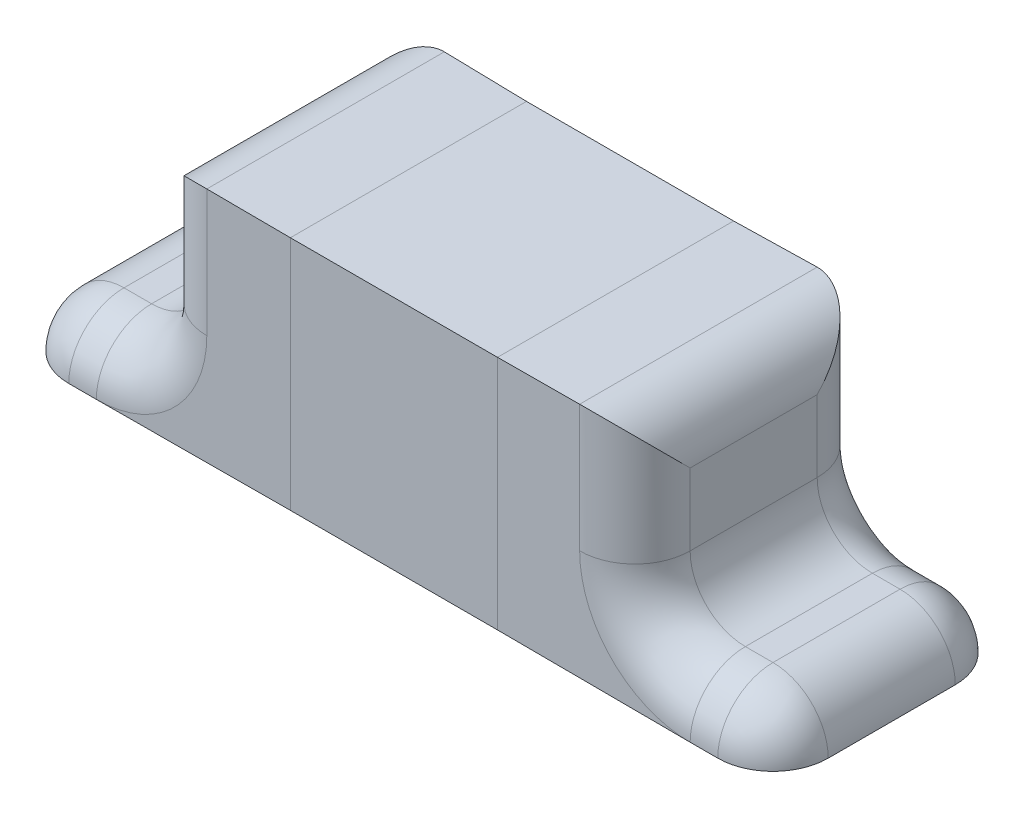
ISO-10303-21;
HEADER;
FILE_DESCRIPTION(('STEP AP214'),'2;1');
FILE_NAME('part.step','',(''),(''),'','','');
FILE_SCHEMA(('AUTOMOTIVE_DESIGN { 1 0 10303 214 1 1 1 1 }'));
ENDSEC;
DATA;
#1=APPLICATION_CONTEXT('core data for automotive mechanical design processes');
#2=APPLICATION_PROTOCOL_DEFINITION('international standard','automotive_design',2000,#1);
#3=PRODUCT_CONTEXT('',#1,'mechanical');
#4=PRODUCT('Part','Part','',(#3));
#5=PRODUCT_RELATED_PRODUCT_CATEGORY('part','',(#4));
#6=PRODUCT_DEFINITION_FORMATION('','',#4);
#7=PRODUCT_DEFINITION_CONTEXT('part definition',#1,'design');
#8=PRODUCT_DEFINITION('design','',#6,#7);
#9=PRODUCT_DEFINITION_SHAPE('','',#8);
#10=(LENGTH_UNIT() NAMED_UNIT(*) SI_UNIT(.MILLI.,.METRE.));
#11=(NAMED_UNIT(*) PLANE_ANGLE_UNIT() SI_UNIT($,.RADIAN.));
#12=(NAMED_UNIT(*) SI_UNIT($,.STERADIAN.) SOLID_ANGLE_UNIT());
#13=UNCERTAINTY_MEASURE_WITH_UNIT(LENGTH_MEASURE(1.E-05),#10,'distance_accuracy_value','');
#14=(GEOMETRIC_REPRESENTATION_CONTEXT(3) GLOBAL_UNCERTAINTY_ASSIGNED_CONTEXT((#13)) GLOBAL_UNIT_ASSIGNED_CONTEXT((#10,
#11,#12)) REPRESENTATION_CONTEXT('',''));
#15=CARTESIAN_POINT('',(0.,0.,0.));
#16=DIRECTION('',(0.,0.,1.));
#17=DIRECTION('',(1.,0.,0.));
#18=AXIS2_PLACEMENT_3D('',#15,#16,#17);
#19=CARTESIAN_POINT('',(0.875,0.,0.));
#20=DIRECTION('',(-1.,0.,0.));
#21=DIRECTION('',(0.,0.,1.));
#22=AXIS2_PLACEMENT_3D('',#19,#20,#21);
#23=PLANE('',#22);
#24=DIRECTION('',(0.,1.,0.));
#25=VECTOR('',#24,1.);
#26=CARTESIAN_POINT('',(0.875,0.,-0.23));
#27=LINE('',#26,#25);
#28=CARTESIAN_POINT('',(0.875,0.398442990090282,-0.23));
#29=VERTEX_POINT('',#28);
#30=CARTESIAN_POINT('',(0.875,0.658442990090282,-0.23));
#31=VERTEX_POINT('',#30);
#32=EDGE_CURVE('E895',#29,#31,#27,.T.);
#33=ORIENTED_EDGE('',*,*,#32,.T.);
#34=DIRECTION('',(0.,0.,1.));
#35=VECTOR('',#34,1.);
#36=CARTESIAN_POINT('',(0.875,0.658442990090282,0.));
#37=LINE('',#36,#35);
#38=CARTESIAN_POINT('',(0.875,0.658442990090282,0.23));
#39=VERTEX_POINT('',#38);
#40=EDGE_CURVE('E453',#31,#39,#37,.T.);
#41=ORIENTED_EDGE('',*,*,#40,.T.);
#42=DIRECTION('',(0.,-1.,0.));
#43=VECTOR('',#42,1.);
#44=CARTESIAN_POINT('',(0.875,0.,0.23));
#45=LINE('',#44,#43);
#46=CARTESIAN_POINT('',(0.875,0.398442990090282,0.23));
#47=VERTEX_POINT('',#46);
#48=EDGE_CURVE('E917',#39,#47,#45,.T.);
#49=ORIENTED_EDGE('',*,*,#48,.T.);
#50=DIRECTION('',(0.,0.,1.));
#51=VECTOR('',#50,1.);
#52=CARTESIAN_POINT('',(0.875,0.398442990090282,-0.43));
#53=LINE('',#52,#51);
#54=EDGE_CURVE('E248',#47,#29,#53,.F.);
#55=ORIENTED_EDGE('',*,*,#54,.T.);
#56=EDGE_LOOP('',(#33,#41,#49,#55));
#57=FACE_BOUND('',#56,.T.);
#58=ADVANCED_FACE('F37',(#57),#23,.F.);
#59=CARTESIAN_POINT('',(0.375,0.,-0.425));
#60=DIRECTION('',(0.,0.,1.));
#61=DIRECTION('',(1.,0.,0.));
#62=AXIS2_PLACEMENT_3D('',#59,#60,#61);
#63=PLANE('',#62);
#64=CARTESIAN_POINT('',(-0.375,0.,-0.425));
#65=DIRECTION('',(0.,1.,0.));
#66=VECTOR('',#65,1.);
#67=LINE('',#64,#66);
#68=CARTESIAN_POINT('',(-0.375,-0.000778504954858498,-0.4275));
#69=VERTEX_POINT('',#68);
#70=CARTESIAN_POINT('',(-0.375,0.854221495045141,-0.4275));
#71=VERTEX_POINT('',#70);
#72=EDGE_CURVE('E200',#69,#71,#67,.T.);
#73=ORIENTED_EDGE('',*,*,#72,.T.);
#74=DIRECTION('',(-1.,0.,0.));
#75=VECTOR('',#74,1.);
#76=CARTESIAN_POINT('',(0.375,0.850000000000001,-0.425));
#77=LINE('',#76,#75);
#78=CARTESIAN_POINT('',(0.375,0.854221495045141,-0.4275));
#79=VERTEX_POINT('',#78);
#80=EDGE_CURVE('E245',#79,#71,#77,.T.);
#81=ORIENTED_EDGE('',*,*,#80,.F.);
#82=CARTESIAN_POINT('',(0.375,-0.00155700990971792,-0.43));
#83=DIRECTION('',(0.,1.,0.));
#84=VECTOR('',#83,1.);
#85=LINE('',#82,#84);
#86=CARTESIAN_POINT('',(0.375,-0.000778504954858498,-0.4275));
#87=VERTEX_POINT('',#86);
#88=EDGE_CURVE('E225',#87,#79,#85,.T.);
#89=ORIENTED_EDGE('',*,*,#88,.F.);
#90=DIRECTION('',(-1.,0.,0.));
#91=VECTOR('',#90,1.);
#92=CARTESIAN_POINT('',(0.375,0.,-0.425));
#93=LINE('',#92,#91);
#94=EDGE_CURVE('E221',#87,#69,#93,.T.);
#95=ORIENTED_EDGE('',*,*,#94,.T.);
#96=EDGE_LOOP('',(#73,#81,#89,#95));
#97=FACE_BOUND('',#96,.T.);
#98=ADVANCED_FACE('F230',(#97),#63,.F.);
#99=CARTESIAN_POINT('',(0.375,0.850000000000001,0.425));
#100=DIRECTION('',(0.,-1.,0.));
#101=DIRECTION('',(0.,0.,-1.));
#102=AXIS2_PLACEMENT_3D('',#99,#100,#101);
#103=PLANE('',#102);
#104=CARTESIAN_POINT('',(-0.375,0.850000000000001,-0.425));
#105=DIRECTION('',(0.,0.,1.));
#106=VECTOR('',#105,1.);
#107=LINE('',#104,#106);
#108=CARTESIAN_POINT('',(-0.375,0.854221495045141,0.4275));
#109=VERTEX_POINT('',#108);
#110=EDGE_CURVE('E211',#71,#109,#107,.T.);
#111=ORIENTED_EDGE('',*,*,#110,.T.);
#112=DIRECTION('',(-1.,0.,0.));
#113=VECTOR('',#112,1.);
#114=CARTESIAN_POINT('',(0.375,0.850000000000001,0.425));
#115=LINE('',#114,#113);
#116=CARTESIAN_POINT('',(0.375,0.854221495045141,0.4275));
#117=VERTEX_POINT('',#116);
#118=EDGE_CURVE('E235',#117,#109,#115,.T.);
#119=ORIENTED_EDGE('',*,*,#118,.F.);
#120=CARTESIAN_POINT('',(0.375,0.858442990090282,-0.43));
#121=DIRECTION('',(0.,0.,1.));
#122=VECTOR('',#121,1.);
#123=LINE('',#120,#122);
#124=EDGE_CURVE('E256',#79,#117,#123,.T.);
#125=ORIENTED_EDGE('',*,*,#124,.F.);
#126=ORIENTED_EDGE('',*,*,#80,.T.);
#127=EDGE_LOOP('',(#111,#119,#125,#126));
#128=FACE_BOUND('',#127,.T.);
#129=ADVANCED_FACE('F262',(#128),#103,.F.);
#130=CARTESIAN_POINT('',(0.375,0.,0.425));
#131=DIRECTION('',(0.,0.,-1.));
#132=DIRECTION('',(-1.,0.,0.));
#133=AXIS2_PLACEMENT_3D('',#130,#131,#132);
#134=PLANE('',#133);
#135=CARTESIAN_POINT('',(-0.375,0.850000000000001,0.425));
#136=DIRECTION('',(0.,-1.,0.));
#137=VECTOR('',#136,1.);
#138=LINE('',#135,#137);
#139=CARTESIAN_POINT('',(-0.375,-0.000778504954858524,0.4275));
#140=VERTEX_POINT('',#139);
#141=EDGE_CURVE('E226',#109,#140,#138,.T.);
#142=ORIENTED_EDGE('',*,*,#141,.T.);
#143=DIRECTION('',(-1.,0.,0.));
#144=VECTOR('',#143,1.);
#145=CARTESIAN_POINT('',(0.375,0.,0.425));
#146=LINE('',#145,#144);
#147=CARTESIAN_POINT('',(0.375,-0.000778504954858524,0.4275));
#148=VERTEX_POINT('',#147);
#149=EDGE_CURVE('E224',#148,#140,#146,.T.);
#150=ORIENTED_EDGE('',*,*,#149,.F.);
#151=CARTESIAN_POINT('',(0.375,0.858442990090282,0.43));
#152=DIRECTION('',(0.,-1.,0.));
#153=VECTOR('',#152,1.);
#154=LINE('',#151,#153);
#155=EDGE_CURVE('E237',#117,#148,#154,.T.);
#156=ORIENTED_EDGE('',*,*,#155,.F.);
#157=ORIENTED_EDGE('',*,*,#118,.T.);
#158=EDGE_LOOP('',(#142,#150,#156,#157));
#159=FACE_BOUND('',#158,.T.);
#160=ADVANCED_FACE('F271',(#159),#134,.F.);
#161=CARTESIAN_POINT('',(0.375,0.,0.425));
#162=DIRECTION('',(0.,1.,0.));
#163=DIRECTION('',(0.,0.,1.));
#164=AXIS2_PLACEMENT_3D('',#161,#162,#163);
#165=PLANE('',#164);
#166=CARTESIAN_POINT('',(-0.375,0.,0.425));
#167=DIRECTION('',(0.,0.,-1.));
#168=VECTOR('',#167,1.);
#169=LINE('',#166,#168);
#170=EDGE_CURVE('E190',#140,#69,#169,.T.);
#171=ORIENTED_EDGE('',*,*,#170,.T.);
#172=ORIENTED_EDGE('',*,*,#94,.F.);
#173=CARTESIAN_POINT('',(0.375,-0.00155700990971797,0.43));
#174=DIRECTION('',(0.,0.,-1.));
#175=VECTOR('',#174,1.);
#176=LINE('',#173,#175);
#177=EDGE_CURVE('E233',#148,#87,#176,.T.);
#178=ORIENTED_EDGE('',*,*,#177,.F.);
#179=ORIENTED_EDGE('',*,*,#149,.T.);
#180=EDGE_LOOP('',(#171,#172,#178,#179));
#181=FACE_BOUND('',#180,.T.);
#182=ADVANCED_FACE('F219',(#181),#165,.F.);
#183=CARTESIAN_POINT('',(0.875,-0.00155700990971792,-0.43));
#184=DIRECTION('',(0.,0.,1.));
#185=DIRECTION('',(1.,0.,0.));
#186=AXIS2_PLACEMENT_3D('',#183,#184,#185);
#187=PLANE('',#186);
#188=DIRECTION('',(-1.,0.,0.));
#189=VECTOR('',#188,1.);
#190=CARTESIAN_POINT('',(0.875,0.858442990090282,-0.43));
#191=LINE('',#190,#189);
#192=CARTESIAN_POINT('',(0.675,0.858442990090282,-0.43));
#193=VERTEX_POINT('',#192);
#194=EDGE_CURVE('E212',#193,#79,#191,.T.);
#195=ORIENTED_EDGE('',*,*,#194,.F.);
#196=DIRECTION('',(0.,1.,0.));
#197=VECTOR('',#196,1.);
#198=CARTESIAN_POINT('',(0.675,-0.00155700990971792,-0.43));
#199=LINE('',#198,#197);
#200=CARTESIAN_POINT('',(0.675,0.398442990090282,-0.43));
#201=VERTEX_POINT('',#200);
#202=EDGE_CURVE('E452',#193,#201,#199,.F.);
#203=ORIENTED_EDGE('',*,*,#202,.T.);
#204=CARTESIAN_POINT('',(1.075,0.398442990090282,-0.43));
#205=DIRECTION('',(0.,0.,1.));
#206=DIRECTION('',(1.,0.,0.));
#207=AXIS2_PLACEMENT_3D('',#204,#205,#206);
#208=CIRCLE('',#207,0.4);
#209=CARTESIAN_POINT('',(1.075,-0.00155700990971792,-0.43));
#210=VERTEX_POINT('',#209);
#211=EDGE_CURVE('E449',#210,#201,#208,.F.);
#212=ORIENTED_EDGE('',*,*,#211,.F.);
#213=DIRECTION('',(-1.,0.,0.));
#214=VECTOR('',#213,1.);
#215=CARTESIAN_POINT('',(0.875,-0.00155700990971792,-0.43));
#216=LINE('',#215,#214);
#217=EDGE_CURVE('E444',#210,#87,#216,.T.);
#218=ORIENTED_EDGE('',*,*,#217,.T.);
#219=ORIENTED_EDGE('',*,*,#88,.T.);
#220=EDGE_LOOP('',(#195,#203,#212,#218,#219));
#221=FACE_BOUND('',#220,.T.);
#222=ADVANCED_FACE('F420',(#221),#187,.F.);
#223=CARTESIAN_POINT('',(0.875,0.858442990090282,0.43));
#224=DIRECTION('',(0.,-1.,0.));
#225=DIRECTION('',(0.,0.,-1.));
#226=AXIS2_PLACEMENT_3D('',#223,#224,#225);
#227=PLANE('',#226);
#228=DIRECTION('',(-1.,0.,0.));
#229=VECTOR('',#228,1.);
#230=CARTESIAN_POINT('',(0.875,0.858442990090282,0.43));
#231=LINE('',#230,#229);
#232=CARTESIAN_POINT('',(0.675,0.858442990090282,0.43));
#233=VERTEX_POINT('',#232);
#234=EDGE_CURVE('E398',#233,#117,#231,.T.);
#235=ORIENTED_EDGE('',*,*,#234,.F.);
#236=DIRECTION('',(0.,0.,1.));
#237=VECTOR('',#236,1.);
#238=CARTESIAN_POINT('',(0.675,0.858442990090282,0.43));
#239=LINE('',#238,#237);
#240=EDGE_CURVE('E910',#233,#193,#239,.F.);
#241=ORIENTED_EDGE('',*,*,#240,.T.);
#242=ORIENTED_EDGE('',*,*,#194,.T.);
#243=ORIENTED_EDGE('',*,*,#124,.T.);
#244=EDGE_LOOP('',(#235,#241,#242,#243));
#245=FACE_BOUND('',#244,.T.);
#246=ADVANCED_FACE('F397',(#245),#227,.F.);
#247=CARTESIAN_POINT('',(0.875,-0.00155700990971797,0.43));
#248=DIRECTION('',(0.,0.,-1.));
#249=DIRECTION('',(-1.,0.,0.));
#250=AXIS2_PLACEMENT_3D('',#247,#248,#249);
#251=PLANE('',#250);
#252=CARTESIAN_POINT('',(1.075,0.398442990090282,0.43));
#253=DIRECTION('',(0.,0.,-1.));
#254=DIRECTION('',(-1.,0.,0.));
#255=AXIS2_PLACEMENT_3D('',#252,#253,#254);
#256=CIRCLE('',#255,0.4);
#257=CARTESIAN_POINT('',(0.675,0.398442990090282,0.43));
#258=VERTEX_POINT('',#257);
#259=CARTESIAN_POINT('',(1.075,-0.00155700990971797,0.43));
#260=VERTEX_POINT('',#259);
#261=EDGE_CURVE('E456',#258,#260,#256,.F.);
#262=ORIENTED_EDGE('',*,*,#261,.F.);
#263=DIRECTION('',(0.,-1.,0.));
#264=VECTOR('',#263,1.);
#265=CARTESIAN_POINT('',(0.675,-0.00155700990971797,0.43));
#266=LINE('',#265,#264);
#267=EDGE_CURVE('E912',#258,#233,#266,.F.);
#268=ORIENTED_EDGE('',*,*,#267,.T.);
#269=ORIENTED_EDGE('',*,*,#234,.T.);
#270=ORIENTED_EDGE('',*,*,#155,.T.);
#271=DIRECTION('',(-1.,0.,0.));
#272=VECTOR('',#271,1.);
#273=CARTESIAN_POINT('',(0.875,-0.00155700990971797,0.43));
#274=LINE('',#273,#272);
#275=EDGE_CURVE('E457',#260,#148,#274,.T.);
#276=ORIENTED_EDGE('',*,*,#275,.F.);
#277=EDGE_LOOP('',(#262,#268,#269,#270,#276));
#278=FACE_BOUND('',#277,.T.);
#279=ADVANCED_FACE('F419',(#278),#251,.F.);
#280=CARTESIAN_POINT('',(0.875,-0.00155700990971797,0.43));
#281=DIRECTION('',(0.,1.,0.));
#282=DIRECTION('',(0.,0.,1.));
#283=AXIS2_PLACEMENT_3D('',#280,#281,#282);
#284=PLANE('',#283);
#285=CARTESIAN_POINT('',(1.175,-0.00155700990971792,-0.43));
#286=VERTEX_POINT('',#285);
#287=EDGE_CURVE('E440',#286,#210,#216,.T.);
#288=ORIENTED_EDGE('',*,*,#287,.F.);
#289=CARTESIAN_POINT('',(1.175,-0.00155700990971793,-0.23));
#290=DIRECTION('',(0.,1.,0.));
#291=DIRECTION('',(0.,0.,1.));
#292=AXIS2_PLACEMENT_3D('',#289,#290,#291);
#293=CIRCLE('',#292,0.2);
#294=CARTESIAN_POINT('',(1.375,-0.00155700990971797,-0.23));
#295=VERTEX_POINT('',#294);
#296=EDGE_CURVE('E474',#286,#295,#293,.F.);
#297=ORIENTED_EDGE('',*,*,#296,.T.);
#298=DIRECTION('',(0.,0.,-1.));
#299=VECTOR('',#298,1.);
#300=CARTESIAN_POINT('',(1.375,-0.00155700990971797,0.43));
#301=LINE('',#300,#299);
#302=CARTESIAN_POINT('',(1.375,-0.00155700990971797,0.23));
#303=VERTEX_POINT('',#302);
#304=EDGE_CURVE('E447',#303,#295,#301,.T.);
#305=ORIENTED_EDGE('',*,*,#304,.F.);
#306=CARTESIAN_POINT('',(1.175,-0.00155700990971796,0.23));
#307=DIRECTION('',(0.,1.,0.));
#308=DIRECTION('',(0.,0.,1.));
#309=AXIS2_PLACEMENT_3D('',#306,#307,#308);
#310=CIRCLE('',#309,0.2);
#311=CARTESIAN_POINT('',(1.175,-0.00155700990971797,0.43));
#312=VERTEX_POINT('',#311);
#313=EDGE_CURVE('E472',#303,#312,#310,.F.);
#314=ORIENTED_EDGE('',*,*,#313,.T.);
#315=EDGE_CURVE('E460',#312,#260,#274,.T.);
#316=ORIENTED_EDGE('',*,*,#315,.T.);
#317=ORIENTED_EDGE('',*,*,#275,.T.);
#318=ORIENTED_EDGE('',*,*,#177,.T.);
#319=ORIENTED_EDGE('',*,*,#217,.F.);
#320=EDGE_LOOP('',(#288,#297,#305,#314,#316,#317,#318,#319));
#321=FACE_BOUND('',#320,.T.);
#322=ADVANCED_FACE('F544',(#321),#284,.F.);
#323=CARTESIAN_POINT('',(1.375,0.198442990090282,0.43));
#324=DIRECTION('',(0.,-1.,0.));
#325=DIRECTION('',(0.,0.,-1.));
#326=AXIS2_PLACEMENT_3D('',#323,#324,#325);
#327=PLANE('',#326);
#328=DIRECTION('',(-1.,0.,0.));
#329=VECTOR('',#328,1.);
#330=CARTESIAN_POINT('',(1.375,0.198442990090282,-0.23));
#331=LINE('',#330,#329);
#332=CARTESIAN_POINT('',(1.175,0.198442990090282,-0.23));
#333=VERTEX_POINT('',#332);
#334=CARTESIAN_POINT('',(1.075,0.198442990090282,-0.23));
#335=VERTEX_POINT('',#334);
#336=EDGE_CURVE('E902',#333,#335,#331,.T.);
#337=ORIENTED_EDGE('',*,*,#336,.T.);
#338=DIRECTION('',(0.,0.,1.));
#339=VECTOR('',#338,1.);
#340=CARTESIAN_POINT('',(1.075,0.198442990090282,0.43));
#341=LINE('',#340,#339);
#342=CARTESIAN_POINT('',(1.075,0.198442990090282,0.23));
#343=VERTEX_POINT('',#342);
#344=EDGE_CURVE('E900',#335,#343,#341,.T.);
#345=ORIENTED_EDGE('',*,*,#344,.T.);
#346=DIRECTION('',(-1.,0.,0.));
#347=VECTOR('',#346,1.);
#348=CARTESIAN_POINT('',(1.375,0.198442990090282,0.23));
#349=LINE('',#348,#347);
#350=CARTESIAN_POINT('',(1.175,0.198442990090282,0.23));
#351=VERTEX_POINT('',#350);
#352=EDGE_CURVE('E905',#343,#351,#349,.F.);
#353=ORIENTED_EDGE('',*,*,#352,.T.);
#354=DIRECTION('',(0.,0.,1.));
#355=VECTOR('',#354,1.);
#356=CARTESIAN_POINT('',(1.175,0.198442990090282,0.43));
#357=LINE('',#356,#355);
#358=EDGE_CURVE('E907',#351,#333,#357,.F.);
#359=ORIENTED_EDGE('',*,*,#358,.T.);
#360=EDGE_LOOP('',(#337,#345,#353,#359));
#361=FACE_BOUND('',#360,.T.);
#362=ADVANCED_FACE('F543',(#361),#327,.F.);
#363=CARTESIAN_POINT('',(0.875,-0.00155700990971797,0.23));
#364=DIRECTION('',(-1.,0.,0.));
#365=DIRECTION('',(0.,0.,1.));
#366=AXIS2_PLACEMENT_3D('',#363,#364,#365);
#367=CYLINDRICAL_SURFACE('',#366,0.2);
#368=ORIENTED_EDGE('',*,*,#315,.F.);
#369=CARTESIAN_POINT('',(1.175,-0.00155700990971797,0.23));
#370=DIRECTION('',(-1.,0.,0.));
#371=DIRECTION('',(0.,0.,1.));
#372=AXIS2_PLACEMENT_3D('',#369,#370,#371);
#373=CIRCLE('',#372,0.2);
#374=EDGE_CURVE('E481',#312,#351,#373,.T.);
#375=ORIENTED_EDGE('',*,*,#374,.T.);
#376=ORIENTED_EDGE('',*,*,#352,.F.);
#377=CARTESIAN_POINT('',(1.075,-0.00155700990971797,0.23));
#378=DIRECTION('',(-1.,0.,0.));
#379=DIRECTION('',(0.,0.,1.));
#380=AXIS2_PLACEMENT_3D('',#377,#378,#379);
#381=CIRCLE('',#380,0.2);
#382=EDGE_CURVE('E593',#260,#343,#381,.T.);
#383=ORIENTED_EDGE('',*,*,#382,.F.);
#384=EDGE_LOOP('',(#368,#375,#376,#383));
#385=FACE_BOUND('',#384,.T.);
#386=ADVANCED_FACE('F559',(#385),#367,.T.);
#387=CARTESIAN_POINT('',(1.175,-0.00155700990971797,0.));
#388=DIRECTION('',(0.,0.,1.));
#389=DIRECTION('',(1.,0.,0.));
#390=AXIS2_PLACEMENT_3D('',#387,#388,#389);
#391=CYLINDRICAL_SURFACE('',#390,0.2);
#392=ORIENTED_EDGE('',*,*,#304,.T.);
#393=CARTESIAN_POINT('',(1.175,-0.00155700990971797,-0.23));
#394=DIRECTION('',(0.,0.,1.));
#395=DIRECTION('',(1.,0.,0.));
#396=AXIS2_PLACEMENT_3D('',#393,#394,#395);
#397=CIRCLE('',#396,0.2);
#398=EDGE_CURVE('E479',#295,#333,#397,.T.);
#399=ORIENTED_EDGE('',*,*,#398,.T.);
#400=ORIENTED_EDGE('',*,*,#358,.F.);
#401=CARTESIAN_POINT('',(1.175,-0.00155700990971797,0.23));
#402=DIRECTION('',(0.,0.,1.));
#403=DIRECTION('',(1.,0.,0.));
#404=AXIS2_PLACEMENT_3D('',#401,#402,#403);
#405=CIRCLE('',#404,0.2);
#406=EDGE_CURVE('E476',#351,#303,#405,.F.);
#407=ORIENTED_EDGE('',*,*,#406,.T.);
#408=EDGE_LOOP('',(#392,#399,#400,#407));
#409=FACE_BOUND('',#408,.T.);
#410=ADVANCED_FACE('F860',(#409),#391,.T.);
#411=CARTESIAN_POINT('',(1.075,0.398442990090282,0.23));
#412=DIRECTION('',(0.,0.,-1.));
#413=DIRECTION('',(-1.,0.,0.));
#414=AXIS2_PLACEMENT_3D('',#411,#412,#413);
#415=TOROIDAL_SURFACE('',#414,0.4,0.2);
#416=ORIENTED_EDGE('',*,*,#261,.T.);
#417=ORIENTED_EDGE('',*,*,#382,.T.);
#418=CARTESIAN_POINT('',(1.075,0.398442990090282,0.23));
#419=DIRECTION('',(0.,0.,-1.));
#420=DIRECTION('',(-1.,0.,0.));
#421=AXIS2_PLACEMENT_3D('',#418,#419,#420);
#422=CIRCLE('',#421,0.2);
#423=EDGE_CURVE('E586',#47,#343,#422,.F.);
#424=ORIENTED_EDGE('',*,*,#423,.F.);
#425=CARTESIAN_POINT('',(0.675,0.398442990090282,0.23));
#426=DIRECTION('',(0.,-1.,0.));
#427=DIRECTION('',(0.,0.,-1.));
#428=AXIS2_PLACEMENT_3D('',#425,#426,#427);
#429=CIRCLE('',#428,0.2);
#430=EDGE_CURVE('E583',#258,#47,#429,.F.);
#431=ORIENTED_EDGE('',*,*,#430,.F.);
#432=EDGE_LOOP('',(#416,#417,#424,#431));
#433=FACE_BOUND('',#432,.T.);
#434=ADVANCED_FACE('F851',(#433),#415,.T.);
#435=CARTESIAN_POINT('',(1.375,-0.00155700990971797,-0.23));
#436=DIRECTION('',(-1.,0.,0.));
#437=DIRECTION('',(0.,0.,1.));
#438=AXIS2_PLACEMENT_3D('',#435,#436,#437);
#439=CYLINDRICAL_SURFACE('',#438,0.2);
#440=ORIENTED_EDGE('',*,*,#336,.F.);
#441=CARTESIAN_POINT('',(1.175,-0.00155700990971797,-0.23));
#442=DIRECTION('',(-1.,0.,0.));
#443=DIRECTION('',(0.,0.,1.));
#444=AXIS2_PLACEMENT_3D('',#441,#442,#443);
#445=CIRCLE('',#444,0.2);
#446=EDGE_CURVE('E471',#333,#286,#445,.T.);
#447=ORIENTED_EDGE('',*,*,#446,.T.);
#448=ORIENTED_EDGE('',*,*,#287,.T.);
#449=CARTESIAN_POINT('',(1.075,-0.00155700990971797,-0.23));
#450=DIRECTION('',(-1.,0.,0.));
#451=DIRECTION('',(0.,0.,1.));
#452=AXIS2_PLACEMENT_3D('',#449,#450,#451);
#453=CIRCLE('',#452,0.2);
#454=EDGE_CURVE('E572',#335,#210,#453,.T.);
#455=ORIENTED_EDGE('',*,*,#454,.F.);
#456=EDGE_LOOP('',(#440,#447,#448,#455));
#457=FACE_BOUND('',#456,.T.);
#458=ADVANCED_FACE('F571',(#457),#439,.T.);
#459=CARTESIAN_POINT('',(1.075,0.398442990090282,0.43));
#460=DIRECTION('',(0.,0.,-1.));
#461=DIRECTION('',(-1.,0.,0.));
#462=AXIS2_PLACEMENT_3D('',#459,#460,#461);
#463=CYLINDRICAL_SURFACE('',#462,0.2);
#464=ORIENTED_EDGE('',*,*,#423,.T.);
#465=ORIENTED_EDGE('',*,*,#344,.F.);
#466=CARTESIAN_POINT('',(1.075,0.398442990090282,-0.23));
#467=DIRECTION('',(0.,0.,1.));
#468=DIRECTION('',(1.,0.,0.));
#469=AXIS2_PLACEMENT_3D('',#466,#467,#468);
#470=CIRCLE('',#469,0.2);
#471=EDGE_CURVE('E582',#29,#335,#470,.T.);
#472=ORIENTED_EDGE('',*,*,#471,.F.);
#473=ORIENTED_EDGE('',*,*,#54,.F.);
#474=EDGE_LOOP('',(#464,#465,#472,#473));
#475=FACE_BOUND('',#474,.T.);
#476=ADVANCED_FACE('F850',(#475),#463,.F.);
#477=CARTESIAN_POINT('',(0.675,0.,0.23));
#478=DIRECTION('',(0.,-1.,0.));
#479=DIRECTION('',(0.,0.,-1.));
#480=AXIS2_PLACEMENT_3D('',#477,#478,#479);
#481=CYLINDRICAL_SURFACE('',#480,0.2);
#482=ORIENTED_EDGE('',*,*,#430,.T.);
#483=ORIENTED_EDGE('',*,*,#48,.F.);
#484=CARTESIAN_POINT('',(0.675,0.658442990090282,0.23));
#485=DIRECTION('',(0.,-0.707106781186547,0.707106781186547));
#486=DIRECTION('',(0.,0.707106781186547,0.707106781186547));
#487=AXIS2_PLACEMENT_3D('',#484,#485,#486);
#488=ELLIPSE('',#487,0.282842712474619,0.2);
#489=EDGE_CURVE('E588',#233,#39,#488,.F.);
#490=ORIENTED_EDGE('',*,*,#489,.F.);
#491=ORIENTED_EDGE('',*,*,#267,.F.);
#492=EDGE_LOOP('',(#482,#483,#490,#491));
#493=FACE_BOUND('',#492,.T.);
#494=ADVANCED_FACE('F882',(#493),#481,.T.);
#495=CARTESIAN_POINT('',(1.075,0.398442990090282,-0.23));
#496=DIRECTION('',(0.,0.,1.));
#497=DIRECTION('',(1.,0.,0.));
#498=AXIS2_PLACEMENT_3D('',#495,#496,#497);
#499=TOROIDAL_SURFACE('',#498,0.4,0.2);
#500=ORIENTED_EDGE('',*,*,#454,.T.);
#501=ORIENTED_EDGE('',*,*,#211,.T.);
#502=CARTESIAN_POINT('',(0.675,0.398442990090282,-0.23));
#503=DIRECTION('',(0.,-1.,0.));
#504=DIRECTION('',(0.,0.,-1.));
#505=AXIS2_PLACEMENT_3D('',#502,#503,#504);
#506=CIRCLE('',#505,0.2);
#507=EDGE_CURVE('E579',#29,#201,#506,.F.);
#508=ORIENTED_EDGE('',*,*,#507,.F.);
#509=ORIENTED_EDGE('',*,*,#471,.T.);
#510=EDGE_LOOP('',(#500,#501,#508,#509));
#511=FACE_BOUND('',#510,.T.);
#512=ADVANCED_FACE('F578',(#511),#499,.T.);
#513=CARTESIAN_POINT('',(0.675,0.658442990090282,0.));
#514=DIRECTION('',(0.,0.,1.));
#515=DIRECTION('',(1.,0.,0.));
#516=AXIS2_PLACEMENT_3D('',#513,#514,#515);
#517=CYLINDRICAL_SURFACE('',#516,0.2);
#518=ORIENTED_EDGE('',*,*,#489,.T.);
#519=ORIENTED_EDGE('',*,*,#40,.F.);
#520=CARTESIAN_POINT('',(0.675,0.658442990090282,-0.23));
#521=DIRECTION('',(0.,0.707106781186547,0.707106781186547));
#522=DIRECTION('',(0.,-0.707106781186547,0.707106781186547));
#523=AXIS2_PLACEMENT_3D('',#520,#521,#522);
#524=ELLIPSE('',#523,0.282842712474619,0.2);
#525=EDGE_CURVE('E301',#193,#31,#524,.F.);
#526=ORIENTED_EDGE('',*,*,#525,.F.);
#527=ORIENTED_EDGE('',*,*,#240,.F.);
#528=EDGE_LOOP('',(#518,#519,#526,#527));
#529=FACE_BOUND('',#528,.T.);
#530=ADVANCED_FACE('F889',(#529),#517,.T.);
#531=CARTESIAN_POINT('',(0.675,0.,-0.23));
#532=DIRECTION('',(0.,1.,0.));
#533=DIRECTION('',(0.,0.,1.));
#534=AXIS2_PLACEMENT_3D('',#531,#532,#533);
#535=CYLINDRICAL_SURFACE('',#534,0.2);
#536=ORIENTED_EDGE('',*,*,#507,.T.);
#537=ORIENTED_EDGE('',*,*,#202,.F.);
#538=ORIENTED_EDGE('',*,*,#525,.T.);
#539=ORIENTED_EDGE('',*,*,#32,.F.);
#540=EDGE_LOOP('',(#536,#537,#538,#539));
#541=FACE_BOUND('',#540,.T.);
#542=ADVANCED_FACE('F639',(#541),#535,.T.);
#543=CARTESIAN_POINT('',(1.175,-0.00155700990971797,-0.23));
#544=DIRECTION('',(0.,0.,1.));
#545=DIRECTION('',(1.,0.,0.));
#546=AXIS2_PLACEMENT_3D('',#543,#544,#545);
#547=SPHERICAL_SURFACE('',#546,0.2);
#548=ORIENTED_EDGE('',*,*,#446,.F.);
#549=ORIENTED_EDGE('',*,*,#398,.F.);
#550=ORIENTED_EDGE('',*,*,#296,.F.);
#551=EDGE_LOOP('',(#548,#549,#550));
#552=FACE_BOUND('',#551,.T.);
#553=ADVANCED_FACE('F633',(#552),#547,.T.);
#554=CARTESIAN_POINT('',(1.175,-0.00155700990971797,0.23));
#555=DIRECTION('',(0.,0.,1.));
#556=DIRECTION('',(1.,0.,0.));
#557=AXIS2_PLACEMENT_3D('',#554,#555,#556);
#558=SPHERICAL_SURFACE('',#557,0.2);
#559=ORIENTED_EDGE('',*,*,#406,.F.);
#560=ORIENTED_EDGE('',*,*,#374,.F.);
#561=ORIENTED_EDGE('',*,*,#313,.F.);
#562=EDGE_LOOP('',(#559,#560,#561));
#563=FACE_BOUND('',#562,.T.);
#564=ADVANCED_FACE('F629',(#563),#558,.T.);
#565=CARTESIAN_POINT('',(-0.875,-0.00155700990971792,-0.43));
#566=DIRECTION('',(0.,0.,-1.));
#567=DIRECTION('',(-1.,0.,0.));
#568=AXIS2_PLACEMENT_3D('',#565,#566,#567);
#569=PLANE('',#568);
#570=CARTESIAN_POINT('',(-1.075,0.398442990090282,-0.43));
#571=DIRECTION('',(0.,0.,-1.));
#572=DIRECTION('',(-1.,0.,0.));
#573=AXIS2_PLACEMENT_3D('',#570,#571,#572);
#574=CIRCLE('',#573,0.4);
#575=CARTESIAN_POINT('',(-0.675,0.398442990090282,-0.43));
#576=VERTEX_POINT('',#575);
#577=CARTESIAN_POINT('',(-1.075,-0.00155700990971792,-0.43));
#578=VERTEX_POINT('',#577);
#579=EDGE_CURVE('E482',#576,#578,#574,.T.);
#580=ORIENTED_EDGE('',*,*,#579,.F.);
#581=DIRECTION('',(0.,1.,0.));
#582=VECTOR('',#581,1.);
#583=CARTESIAN_POINT('',(-0.675,0.858442990090282,-0.43));
#584=LINE('',#583,#582);
#585=CARTESIAN_POINT('',(-0.675,0.858442990090282,-0.43));
#586=VERTEX_POINT('',#585);
#587=EDGE_CURVE('E496',#576,#586,#584,.T.);
#588=ORIENTED_EDGE('',*,*,#587,.T.);
#589=DIRECTION('',(1.,0.,0.));
#590=VECTOR('',#589,1.);
#591=CARTESIAN_POINT('',(-0.875,0.858442990090282,-0.43));
#592=LINE('',#591,#590);
#593=EDGE_CURVE('E205',#586,#71,#592,.T.);
#594=ORIENTED_EDGE('',*,*,#593,.T.);
#595=ORIENTED_EDGE('',*,*,#72,.F.);
#596=DIRECTION('',(1.,0.,0.));
#597=VECTOR('',#596,1.);
#598=CARTESIAN_POINT('',(-0.875,-0.00155700990971792,-0.43));
#599=LINE('',#598,#597);
#600=EDGE_CURVE('E185',#578,#69,#599,.T.);
#601=ORIENTED_EDGE('',*,*,#600,.F.);
#602=EDGE_LOOP('',(#580,#588,#594,#595,#601));
#603=FACE_BOUND('',#602,.T.);
#604=ADVANCED_FACE('F202',(#603),#569,.T.);
#605=CARTESIAN_POINT('',(-0.875,-0.00155700990971797,0.43));
#606=DIRECTION('',(0.,-1.,0.));
#607=DIRECTION('',(0.,0.,-1.));
#608=AXIS2_PLACEMENT_3D('',#605,#606,#607);
#609=PLANE('',#608);
#610=DIRECTION('',(0.,0.,-1.));
#611=VECTOR('',#610,1.);
#612=CARTESIAN_POINT('',(-1.375,-0.00155700990971797,0.43));
#613=LINE('',#612,#611);
#614=CARTESIAN_POINT('',(-1.375,-0.00155700990971797,0.23));
#615=VERTEX_POINT('',#614);
#616=CARTESIAN_POINT('',(-1.375,-0.00155700990971797,-0.23));
#617=VERTEX_POINT('',#616);
#618=EDGE_CURVE('E371',#615,#617,#613,.T.);
#619=ORIENTED_EDGE('',*,*,#618,.T.);
#620=CARTESIAN_POINT('',(-1.175,-0.00155700990971793,-0.23));
#621=DIRECTION('',(0.,-1.,0.));
#622=DIRECTION('',(0.,0.,-1.));
#623=AXIS2_PLACEMENT_3D('',#620,#621,#622);
#624=CIRCLE('',#623,0.2);
#625=CARTESIAN_POINT('',(-1.175,-0.00155700990971792,-0.43));
#626=VERTEX_POINT('',#625);
#627=EDGE_CURVE('E45',#617,#626,#624,.T.);
#628=ORIENTED_EDGE('',*,*,#627,.T.);
#629=EDGE_CURVE('E194',#626,#578,#599,.T.);
#630=ORIENTED_EDGE('',*,*,#629,.T.);
#631=ORIENTED_EDGE('',*,*,#600,.T.);
#632=ORIENTED_EDGE('',*,*,#170,.F.);
#633=DIRECTION('',(1.,0.,0.));
#634=VECTOR('',#633,1.);
#635=CARTESIAN_POINT('',(-0.875,-0.00155700990971797,0.43));
#636=LINE('',#635,#634);
#637=CARTESIAN_POINT('',(-1.075,-0.00155700990971797,0.43));
#638=VERTEX_POINT('',#637);
#639=EDGE_CURVE('E315',#638,#140,#636,.T.);
#640=ORIENTED_EDGE('',*,*,#639,.F.);
#641=CARTESIAN_POINT('',(-1.175,-0.00155700990971797,0.43));
#642=VERTEX_POINT('',#641);
#643=EDGE_CURVE('E197',#642,#638,#636,.T.);
#644=ORIENTED_EDGE('',*,*,#643,.F.);
#645=CARTESIAN_POINT('',(-1.175,-0.00155700990971796,0.23));
#646=DIRECTION('',(0.,-1.,0.));
#647=DIRECTION('',(0.,0.,-1.));
#648=AXIS2_PLACEMENT_3D('',#645,#646,#647);
#649=CIRCLE('',#648,0.2);
#650=EDGE_CURVE('E312',#642,#615,#649,.T.);
#651=ORIENTED_EDGE('',*,*,#650,.T.);
#652=EDGE_LOOP('',(#619,#628,#630,#631,#632,#640,#644,#651));
#653=FACE_BOUND('',#652,.T.);
#654=ADVANCED_FACE('F187',(#653),#609,.T.);
#655=CARTESIAN_POINT('',(-0.875,-0.00155700990971797,0.43));
#656=DIRECTION('',(0.,0.,1.));
#657=DIRECTION('',(1.,0.,0.));
#658=AXIS2_PLACEMENT_3D('',#655,#656,#657);
#659=PLANE('',#658);
#660=DIRECTION('',(1.,0.,0.));
#661=VECTOR('',#660,1.);
#662=CARTESIAN_POINT('',(-0.875,0.858442990090282,0.43));
#663=LINE('',#662,#661);
#664=CARTESIAN_POINT('',(-0.675,0.858442990090282,0.43));
#665=VERTEX_POINT('',#664);
#666=EDGE_CURVE('E328',#665,#109,#663,.T.);
#667=ORIENTED_EDGE('',*,*,#666,.F.);
#668=DIRECTION('',(0.,-1.,0.));
#669=VECTOR('',#668,1.);
#670=CARTESIAN_POINT('',(-0.675,0.198442990090282,0.43));
#671=LINE('',#670,#669);
#672=CARTESIAN_POINT('',(-0.675,0.398442990090282,0.43));
#673=VERTEX_POINT('',#672);
#674=EDGE_CURVE('E334',#665,#673,#671,.T.);
#675=ORIENTED_EDGE('',*,*,#674,.T.);
#676=CARTESIAN_POINT('',(-1.075,0.398442990090282,0.43));
#677=DIRECTION('',(0.,0.,1.));
#678=DIRECTION('',(1.,0.,0.));
#679=AXIS2_PLACEMENT_3D('',#676,#677,#678);
#680=CIRCLE('',#679,0.4);
#681=EDGE_CURVE('E331',#638,#673,#680,.T.);
#682=ORIENTED_EDGE('',*,*,#681,.F.);
#683=ORIENTED_EDGE('',*,*,#639,.T.);
#684=ORIENTED_EDGE('',*,*,#141,.F.);
#685=EDGE_LOOP('',(#667,#675,#682,#683,#684));
#686=FACE_BOUND('',#685,.T.);
#687=ADVANCED_FACE('F382',(#686),#659,.T.);
#688=CARTESIAN_POINT('',(-0.875,0.858442990090282,0.43));
#689=DIRECTION('',(0.,1.,0.));
#690=DIRECTION('',(0.,0.,1.));
#691=AXIS2_PLACEMENT_3D('',#688,#689,#690);
#692=PLANE('',#691);
#693=ORIENTED_EDGE('',*,*,#593,.F.);
#694=DIRECTION('',(0.,0.,1.));
#695=VECTOR('',#694,1.);
#696=CARTESIAN_POINT('',(-0.675,0.858442990090282,0.43));
#697=LINE('',#696,#695);
#698=EDGE_CURVE('E337',#586,#665,#697,.T.);
#699=ORIENTED_EDGE('',*,*,#698,.T.);
#700=ORIENTED_EDGE('',*,*,#666,.T.);
#701=ORIENTED_EDGE('',*,*,#110,.F.);
#702=EDGE_LOOP('',(#693,#699,#700,#701));
#703=FACE_BOUND('',#702,.T.);
#704=ADVANCED_FACE('F377',(#703),#692,.T.);
#705=CARTESIAN_POINT('',(-0.875,0.,0.));
#706=DIRECTION('',(1.,0.,0.));
#707=DIRECTION('',(0.,0.,1.));
#708=AXIS2_PLACEMENT_3D('',#705,#706,#707);
#709=PLANE('',#708);
#710=DIRECTION('',(0.,-1.,0.));
#711=VECTOR('',#710,1.);
#712=CARTESIAN_POINT('',(-0.875,0.858442990090282,0.23));
#713=LINE('',#712,#711);
#714=CARTESIAN_POINT('',(-0.875,0.398442990090282,0.23));
#715=VERTEX_POINT('',#714);
#716=CARTESIAN_POINT('',(-0.875,0.658442990090282,0.23));
#717=VERTEX_POINT('',#716);
#718=EDGE_CURVE('E503',#715,#717,#713,.F.);
#719=ORIENTED_EDGE('',*,*,#718,.T.);
#720=DIRECTION('',(0.,0.,1.));
#721=VECTOR('',#720,1.);
#722=CARTESIAN_POINT('',(-0.875,0.658442990090282,-0.43));
#723=LINE('',#722,#721);
#724=CARTESIAN_POINT('',(-0.875,0.658442990090282,-0.23));
#725=VERTEX_POINT('',#724);
#726=EDGE_CURVE('E335',#717,#725,#723,.F.);
#727=ORIENTED_EDGE('',*,*,#726,.T.);
#728=DIRECTION('',(0.,1.,0.));
#729=VECTOR('',#728,1.);
#730=CARTESIAN_POINT('',(-0.875,0.198442990090282,-0.23));
#731=LINE('',#730,#729);
#732=CARTESIAN_POINT('',(-0.875,0.398442990090282,-0.23));
#733=VERTEX_POINT('',#732);
#734=EDGE_CURVE('E505',#725,#733,#731,.F.);
#735=ORIENTED_EDGE('',*,*,#734,.T.);
#736=DIRECTION('',(0.,0.,1.));
#737=VECTOR('',#736,1.);
#738=CARTESIAN_POINT('',(-0.875,0.398442990090282,0.));
#739=LINE('',#738,#737);
#740=EDGE_CURVE('E499',#733,#715,#739,.T.);
#741=ORIENTED_EDGE('',*,*,#740,.T.);
#742=EDGE_LOOP('',(#719,#727,#735,#741));
#743=FACE_BOUND('',#742,.T.);
#744=ADVANCED_FACE('F510',(#743),#709,.F.);
#745=CARTESIAN_POINT('',(-1.375,0.198442990090282,0.43));
#746=DIRECTION('',(0.,1.,0.));
#747=DIRECTION('',(0.,0.,1.));
#748=AXIS2_PLACEMENT_3D('',#745,#746,#747);
#749=PLANE('',#748);
#750=DIRECTION('',(1.,0.,0.));
#751=VECTOR('',#750,1.);
#752=CARTESIAN_POINT('',(-1.375,0.198442990090282,0.23));
#753=LINE('',#752,#751);
#754=CARTESIAN_POINT('',(-1.175,0.198442990090282,0.23));
#755=VERTEX_POINT('',#754);
#756=CARTESIAN_POINT('',(-1.075,0.198442990090282,0.23));
#757=VERTEX_POINT('',#756);
#758=EDGE_CURVE('E342',#755,#757,#753,.T.);
#759=ORIENTED_EDGE('',*,*,#758,.T.);
#760=DIRECTION('',(0.,0.,1.));
#761=VECTOR('',#760,1.);
#762=CARTESIAN_POINT('',(-1.075,0.198442990090282,0.43));
#763=LINE('',#762,#761);
#764=CARTESIAN_POINT('',(-1.075,0.198442990090282,-0.23));
#765=VERTEX_POINT('',#764);
#766=EDGE_CURVE('E308',#757,#765,#763,.F.);
#767=ORIENTED_EDGE('',*,*,#766,.T.);
#768=DIRECTION('',(1.,0.,0.));
#769=VECTOR('',#768,1.);
#770=CARTESIAN_POINT('',(-1.375,0.198442990090282,-0.23));
#771=LINE('',#770,#769);
#772=CARTESIAN_POINT('',(-1.175,0.198442990090282,-0.23));
#773=VERTEX_POINT('',#772);
#774=EDGE_CURVE('E344',#765,#773,#771,.F.);
#775=ORIENTED_EDGE('',*,*,#774,.T.);
#776=DIRECTION('',(0.,0.,1.));
#777=VECTOR('',#776,1.);
#778=CARTESIAN_POINT('',(-1.175,0.198442990090282,0.43));
#779=LINE('',#778,#777);
#780=EDGE_CURVE('E339',#773,#755,#779,.T.);
#781=ORIENTED_EDGE('',*,*,#780,.T.);
#782=EDGE_LOOP('',(#759,#767,#775,#781));
#783=FACE_BOUND('',#782,.T.);
#784=ADVANCED_FACE('F670',(#783),#749,.T.);
#785=CARTESIAN_POINT('',(-1.375,-0.00155700990971797,0.23));
#786=DIRECTION('',(1.,0.,0.));
#787=DIRECTION('',(0.,0.,-1.));
#788=AXIS2_PLACEMENT_3D('',#785,#786,#787);
#789=CYLINDRICAL_SURFACE('',#788,0.2);
#790=ORIENTED_EDGE('',*,*,#758,.F.);
#791=CARTESIAN_POINT('',(-1.175,-0.00155700990971797,0.23));
#792=DIRECTION('',(1.,0.,0.));
#793=DIRECTION('',(0.,0.,-1.));
#794=AXIS2_PLACEMENT_3D('',#791,#792,#793);
#795=CIRCLE('',#794,0.2);
#796=EDGE_CURVE('E11',#755,#642,#795,.T.);
#797=ORIENTED_EDGE('',*,*,#796,.T.);
#798=ORIENTED_EDGE('',*,*,#643,.T.);
#799=CARTESIAN_POINT('',(-1.075,-0.00155700990971797,0.23));
#800=DIRECTION('',(1.,0.,0.));
#801=DIRECTION('',(0.,0.,-1.));
#802=AXIS2_PLACEMENT_3D('',#799,#800,#801);
#803=CIRCLE('',#802,0.2);
#804=EDGE_CURVE('E302',#757,#638,#803,.T.);
#805=ORIENTED_EDGE('',*,*,#804,.F.);
#806=EDGE_LOOP('',(#790,#797,#798,#805));
#807=FACE_BOUND('',#806,.T.);
#808=ADVANCED_FACE('F667',(#807),#789,.T.);
#809=CARTESIAN_POINT('',(-1.175,-0.00155700990971797,0.43));
#810=DIRECTION('',(0.,0.,-1.));
#811=DIRECTION('',(-1.,0.,0.));
#812=AXIS2_PLACEMENT_3D('',#809,#810,#811);
#813=CYLINDRICAL_SURFACE('',#812,0.2);
#814=ORIENTED_EDGE('',*,*,#780,.F.);
#815=CARTESIAN_POINT('',(-1.175,-0.00155700990971797,-0.23));
#816=DIRECTION('',(0.,0.,-1.));
#817=DIRECTION('',(-1.,0.,0.));
#818=AXIS2_PLACEMENT_3D('',#815,#816,#817);
#819=CIRCLE('',#818,0.2);
#820=EDGE_CURVE('E58',#773,#617,#819,.F.);
#821=ORIENTED_EDGE('',*,*,#820,.T.);
#822=ORIENTED_EDGE('',*,*,#618,.F.);
#823=CARTESIAN_POINT('',(-1.175,-0.00155700990971797,0.23));
#824=DIRECTION('',(0.,0.,-1.));
#825=DIRECTION('',(-1.,0.,0.));
#826=AXIS2_PLACEMENT_3D('',#823,#824,#825);
#827=CIRCLE('',#826,0.2);
#828=EDGE_CURVE('E307',#615,#755,#827,.T.);
#829=ORIENTED_EDGE('',*,*,#828,.T.);
#830=EDGE_LOOP('',(#814,#821,#822,#829));
#831=FACE_BOUND('',#830,.T.);
#832=ADVANCED_FACE('F533',(#831),#813,.T.);
#833=CARTESIAN_POINT('',(-1.075,0.398442990090282,0.23));
#834=DIRECTION('',(0.,0.,1.));
#835=DIRECTION('',(1.,0.,0.));
#836=AXIS2_PLACEMENT_3D('',#833,#834,#835);
#837=TOROIDAL_SURFACE('',#836,0.4,0.2);
#838=CARTESIAN_POINT('',(-0.675,0.398442990090282,0.23));
#839=DIRECTION('',(0.,-1.,0.));
#840=DIRECTION('',(0.,0.,-1.));
#841=AXIS2_PLACEMENT_3D('',#838,#839,#840);
#842=CIRCLE('',#841,0.2);
#843=EDGE_CURVE('E361',#715,#673,#842,.F.);
#844=ORIENTED_EDGE('',*,*,#843,.F.);
#845=CARTESIAN_POINT('',(-1.075,0.398442990090282,0.23));
#846=DIRECTION('',(0.,0.,1.));
#847=DIRECTION('',(1.,0.,0.));
#848=AXIS2_PLACEMENT_3D('',#845,#846,#847);
#849=CIRCLE('',#848,0.2);
#850=EDGE_CURVE('E363',#757,#715,#849,.T.);
#851=ORIENTED_EDGE('',*,*,#850,.F.);
#852=ORIENTED_EDGE('',*,*,#804,.T.);
#853=ORIENTED_EDGE('',*,*,#681,.T.);
#854=EDGE_LOOP('',(#844,#851,#852,#853));
#855=FACE_BOUND('',#854,.T.);
#856=ADVANCED_FACE('F524',(#855),#837,.T.);
#857=CARTESIAN_POINT('',(-1.075,0.398442990090282,0.));
#858=DIRECTION('',(0.,0.,1.));
#859=DIRECTION('',(1.,0.,0.));
#860=AXIS2_PLACEMENT_3D('',#857,#858,#859);
#861=CYLINDRICAL_SURFACE('',#860,0.2);
#862=ORIENTED_EDGE('',*,*,#850,.T.);
#863=ORIENTED_EDGE('',*,*,#740,.F.);
#864=CARTESIAN_POINT('',(-1.075,0.398442990090282,-0.23));
#865=DIRECTION('',(0.,0.,-1.));
#866=DIRECTION('',(-1.,0.,0.));
#867=AXIS2_PLACEMENT_3D('',#864,#865,#866);
#868=CIRCLE('',#867,0.2);
#869=EDGE_CURVE('E358',#765,#733,#868,.F.);
#870=ORIENTED_EDGE('',*,*,#869,.F.);
#871=ORIENTED_EDGE('',*,*,#766,.F.);
#872=EDGE_LOOP('',(#862,#863,#870,#871));
#873=FACE_BOUND('',#872,.T.);
#874=ADVANCED_FACE('F521',(#873),#861,.F.);
#875=CARTESIAN_POINT('',(-0.875,-0.00155700990971797,-0.23));
#876=DIRECTION('',(1.,0.,0.));
#877=DIRECTION('',(0.,0.,-1.));
#878=AXIS2_PLACEMENT_3D('',#875,#876,#877);
#879=CYLINDRICAL_SURFACE('',#878,0.2);
#880=ORIENTED_EDGE('',*,*,#629,.F.);
#881=CARTESIAN_POINT('',(-1.175,-0.00155700990971797,-0.23));
#882=DIRECTION('',(1.,0.,0.));
#883=DIRECTION('',(0.,0.,-1.));
#884=AXIS2_PLACEMENT_3D('',#881,#882,#883);
#885=CIRCLE('',#884,0.2);
#886=EDGE_CURVE('E304',#626,#773,#885,.T.);
#887=ORIENTED_EDGE('',*,*,#886,.T.);
#888=ORIENTED_EDGE('',*,*,#774,.F.);
#889=CARTESIAN_POINT('',(-1.075,-0.00155700990971797,-0.23));
#890=DIRECTION('',(1.,0.,0.));
#891=DIRECTION('',(0.,0.,-1.));
#892=AXIS2_PLACEMENT_3D('',#889,#890,#891);
#893=CIRCLE('',#892,0.2);
#894=EDGE_CURVE('E355',#578,#765,#893,.T.);
#895=ORIENTED_EDGE('',*,*,#894,.F.);
#896=EDGE_LOOP('',(#880,#887,#888,#895));
#897=FACE_BOUND('',#896,.T.);
#898=ADVANCED_FACE('F523',(#897),#879,.T.);
#899=CARTESIAN_POINT('',(-0.675,-0.00155700990971797,0.23));
#900=DIRECTION('',(0.,1.,0.));
#901=DIRECTION('',(0.,0.,1.));
#902=AXIS2_PLACEMENT_3D('',#899,#900,#901);
#903=CYLINDRICAL_SURFACE('',#902,0.2);
#904=ORIENTED_EDGE('',*,*,#843,.T.);
#905=ORIENTED_EDGE('',*,*,#674,.F.);
#906=CARTESIAN_POINT('',(-0.675,0.658442990090282,0.23));
#907=DIRECTION('',(0.,0.707106781186547,-0.707106781186547));
#908=DIRECTION('',(0.,-0.707106781186547,-0.707106781186547));
#909=AXIS2_PLACEMENT_3D('',#906,#907,#908);
#910=ELLIPSE('',#909,0.282842712474619,0.2);
#911=EDGE_CURVE('E352',#717,#665,#910,.T.);
#912=ORIENTED_EDGE('',*,*,#911,.F.);
#913=ORIENTED_EDGE('',*,*,#718,.F.);
#914=EDGE_LOOP('',(#904,#905,#912,#913));
#915=FACE_BOUND('',#914,.T.);
#916=ADVANCED_FACE('F530',(#915),#903,.T.);
#917=CARTESIAN_POINT('',(-1.075,0.398442990090282,-0.23));
#918=DIRECTION('',(0.,0.,-1.));
#919=DIRECTION('',(-1.,0.,0.));
#920=AXIS2_PLACEMENT_3D('',#917,#918,#919);
#921=TOROIDAL_SURFACE('',#920,0.4,0.2);
#922=ORIENTED_EDGE('',*,*,#894,.T.);
#923=ORIENTED_EDGE('',*,*,#869,.T.);
#924=CARTESIAN_POINT('',(-0.675,0.398442990090282,-0.23));
#925=DIRECTION('',(0.,-1.,0.));
#926=DIRECTION('',(0.,0.,-1.));
#927=AXIS2_PLACEMENT_3D('',#924,#925,#926);
#928=CIRCLE('',#927,0.2);
#929=EDGE_CURVE('E350',#576,#733,#928,.F.);
#930=ORIENTED_EDGE('',*,*,#929,.F.);
#931=ORIENTED_EDGE('',*,*,#579,.T.);
#932=EDGE_LOOP('',(#922,#923,#930,#931));
#933=FACE_BOUND('',#932,.T.);
#934=ADVANCED_FACE('F519',(#933),#921,.T.);
#935=CARTESIAN_POINT('',(-0.675,0.658442990090282,0.43));
#936=DIRECTION('',(0.,0.,-1.));
#937=DIRECTION('',(-1.,0.,0.));
#938=AXIS2_PLACEMENT_3D('',#935,#936,#937);
#939=CYLINDRICAL_SURFACE('',#938,0.2);
#940=ORIENTED_EDGE('',*,*,#911,.T.);
#941=ORIENTED_EDGE('',*,*,#698,.F.);
#942=CARTESIAN_POINT('',(-0.675,0.658442990090282,-0.23));
#943=DIRECTION('',(0.,-0.707106781186547,-0.707106781186547));
#944=DIRECTION('',(0.,0.707106781186547,-0.707106781186547));
#945=AXIS2_PLACEMENT_3D('',#942,#943,#944);
#946=ELLIPSE('',#945,0.282842712474619,0.2);
#947=EDGE_CURVE('E348',#725,#586,#946,.T.);
#948=ORIENTED_EDGE('',*,*,#947,.F.);
#949=ORIENTED_EDGE('',*,*,#726,.F.);
#950=EDGE_LOOP('',(#940,#941,#948,#949));
#951=FACE_BOUND('',#950,.T.);
#952=ADVANCED_FACE('F518',(#951),#939,.T.);
#953=CARTESIAN_POINT('',(-0.675,-0.00155700990971792,-0.23));
#954=DIRECTION('',(0.,-1.,0.));
#955=DIRECTION('',(0.,0.,-1.));
#956=AXIS2_PLACEMENT_3D('',#953,#954,#955);
#957=CYLINDRICAL_SURFACE('',#956,0.2);
#958=ORIENTED_EDGE('',*,*,#929,.T.);
#959=ORIENTED_EDGE('',*,*,#734,.F.);
#960=ORIENTED_EDGE('',*,*,#947,.T.);
#961=ORIENTED_EDGE('',*,*,#587,.F.);
#962=EDGE_LOOP('',(#958,#959,#960,#961));
#963=FACE_BOUND('',#962,.T.);
#964=ADVANCED_FACE('F516',(#963),#957,.T.);
#965=CARTESIAN_POINT('',(-1.175,-0.00155700990971797,-0.23));
#966=DIRECTION('',(0.,0.,1.));
#967=DIRECTION('',(1.,0.,0.));
#968=AXIS2_PLACEMENT_3D('',#965,#966,#967);
#969=SPHERICAL_SURFACE('',#968,0.2);
#970=ORIENTED_EDGE('',*,*,#627,.F.);
#971=ORIENTED_EDGE('',*,*,#820,.F.);
#972=ORIENTED_EDGE('',*,*,#886,.F.);
#973=EDGE_LOOP('',(#970,#971,#972));
#974=FACE_BOUND('',#973,.T.);
#975=ADVANCED_FACE('F647',(#974),#969,.T.);
#976=CARTESIAN_POINT('',(-1.175,-0.00155700990971797,0.23));
#977=DIRECTION('',(0.,0.,1.));
#978=DIRECTION('',(1.,0.,0.));
#979=AXIS2_PLACEMENT_3D('',#976,#977,#978);
#980=SPHERICAL_SURFACE('',#979,0.2);
#981=ORIENTED_EDGE('',*,*,#650,.F.);
#982=ORIENTED_EDGE('',*,*,#796,.F.);
#983=ORIENTED_EDGE('',*,*,#828,.F.);
#984=EDGE_LOOP('',(#981,#982,#983));
#985=FACE_BOUND('',#984,.T.);
#986=ADVANCED_FACE('F39',(#985),#980,.T.);
#987=CLOSED_SHELL('',(#58,#98,#129,#160,#182,#222,#246,#279,#322,#362,#386,#410,#434,#458,#476,
#494,#512,#530,#542,#553,#564,#604,#654,#687,#704,#744,#784,#808,#832,#856,#874,#898,#916,#934,
#952,#964,#975,#986));
#988=MANIFOLD_SOLID_BREP('B2',#987);
#989=ADVANCED_BREP_SHAPE_REPRESENTATION('',(#18,#988),#14);
#990=SHAPE_DEFINITION_REPRESENTATION(#9,#989);
ENDSEC;
END-ISO-10303-21;
